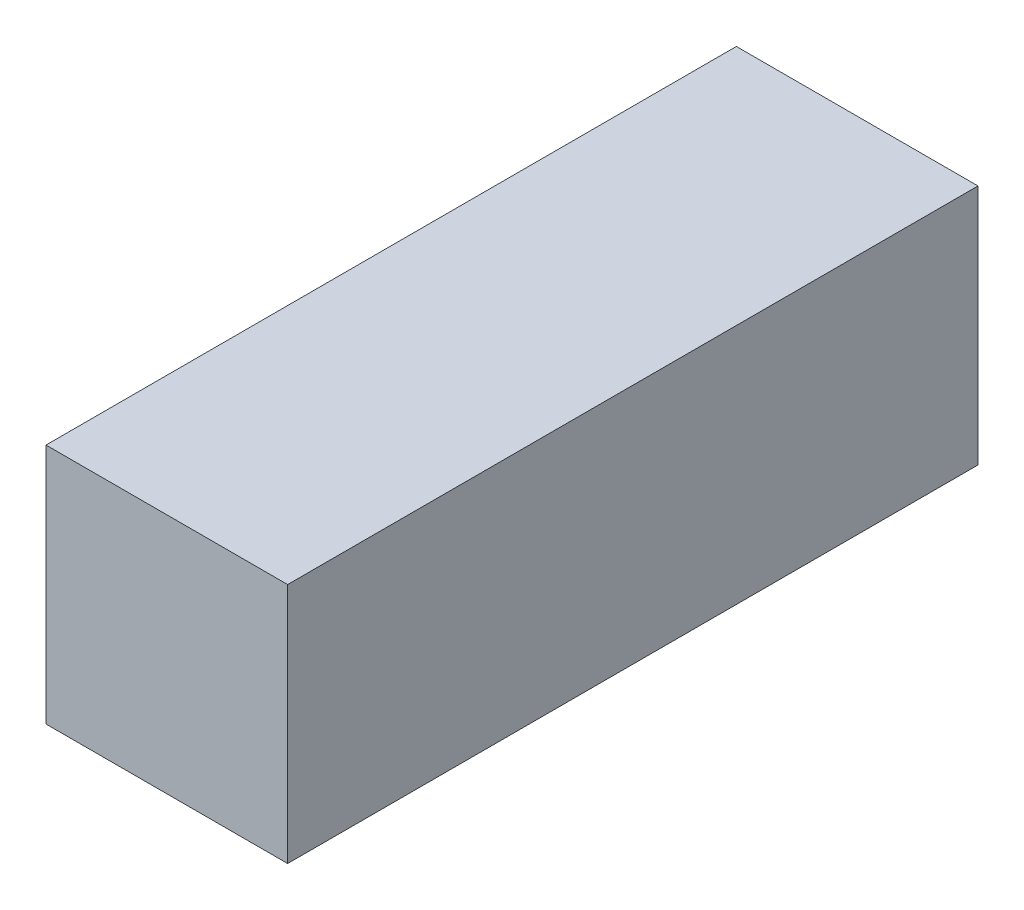
ISO-10303-21;
HEADER;
FILE_DESCRIPTION(('STEP AP214'),'2;1');
FILE_NAME('part.step','',(''),(''),'','','');
FILE_SCHEMA(('AUTOMOTIVE_DESIGN { 1 0 10303 214 1 1 1 1 }'));
ENDSEC;
DATA;
#1=APPLICATION_CONTEXT('core data for automotive mechanical design processes');
#2=APPLICATION_PROTOCOL_DEFINITION('international standard','automotive_design',2000,#1);
#3=PRODUCT_CONTEXT('',#1,'mechanical');
#4=PRODUCT('Part','Part','',(#3));
#5=PRODUCT_RELATED_PRODUCT_CATEGORY('part','',(#4));
#6=PRODUCT_DEFINITION_FORMATION('','',#4);
#7=PRODUCT_DEFINITION_CONTEXT('part definition',#1,'design');
#8=PRODUCT_DEFINITION('design','',#6,#7);
#9=PRODUCT_DEFINITION_SHAPE('','',#8);
#10=(LENGTH_UNIT() NAMED_UNIT(*) SI_UNIT(.MILLI.,.METRE.));
#11=(NAMED_UNIT(*) PLANE_ANGLE_UNIT() SI_UNIT($,.RADIAN.));
#12=(NAMED_UNIT(*) SI_UNIT($,.STERADIAN.) SOLID_ANGLE_UNIT());
#13=UNCERTAINTY_MEASURE_WITH_UNIT(LENGTH_MEASURE(1.E-05),#10,'distance_accuracy_value','');
#14=(GEOMETRIC_REPRESENTATION_CONTEXT(3) GLOBAL_UNCERTAINTY_ASSIGNED_CONTEXT((#13)) GLOBAL_UNIT_ASSIGNED_CONTEXT((#10,
#11,#12)) REPRESENTATION_CONTEXT('',''));
#15=CARTESIAN_POINT('',(0.,0.,0.));
#16=DIRECTION('',(0.,0.,1.));
#17=DIRECTION('',(1.,0.,0.));
#18=AXIS2_PLACEMENT_3D('',#15,#16,#17);
#19=CARTESIAN_POINT('',(0.,0.,20.));
#20=DIRECTION('',(1.,0.,0.));
#21=DIRECTION('',(0.,0.,-1.));
#22=AXIS2_PLACEMENT_3D('',#19,#20,#21);
#23=PLANE('',#22);
#24=DIRECTION('',(0.,-1.,0.));
#25=VECTOR('',#24,1.);
#26=CARTESIAN_POINT('',(0.,0.,0.));
#27=LINE('',#26,#25);
#28=CARTESIAN_POINT('',(0.,7.,0.));
#29=VERTEX_POINT('',#28);
#30=CARTESIAN_POINT('',(0.,0.,0.));
#31=VERTEX_POINT('',#30);
#32=EDGE_CURVE('E96',#29,#31,#27,.T.);
#33=ORIENTED_EDGE('',*,*,#32,.T.);
#34=DIRECTION('',(0.,0.,-1.));
#35=VECTOR('',#34,1.);
#36=CARTESIAN_POINT('',(0.,0.,20.));
#37=LINE('',#36,#35);
#38=CARTESIAN_POINT('',(0.,0.,20.));
#39=VERTEX_POINT('',#38);
#40=EDGE_CURVE('E11',#39,#31,#37,.T.);
#41=ORIENTED_EDGE('',*,*,#40,.F.);
#42=DIRECTION('',(0.,-1.,0.));
#43=VECTOR('',#42,1.);
#44=CARTESIAN_POINT('',(0.,0.,20.));
#45=LINE('',#44,#43);
#46=CARTESIAN_POINT('',(0.,7.,20.));
#47=VERTEX_POINT('',#46);
#48=EDGE_CURVE('E84',#47,#39,#45,.T.);
#49=ORIENTED_EDGE('',*,*,#48,.F.);
#50=DIRECTION('',(0.,0.,-1.));
#51=VECTOR('',#50,1.);
#52=CARTESIAN_POINT('',(0.,7.,20.));
#53=LINE('',#52,#51);
#54=EDGE_CURVE('E92',#47,#29,#53,.T.);
#55=ORIENTED_EDGE('',*,*,#54,.T.);
#56=EDGE_LOOP('',(#33,#41,#49,#55));
#57=FACE_BOUND('',#56,.T.);
#58=ADVANCED_FACE('F33',(#57),#23,.F.);
#59=CARTESIAN_POINT('',(0.,0.,20.));
#60=DIRECTION('',(0.,1.,0.));
#61=DIRECTION('',(0.,0.,1.));
#62=AXIS2_PLACEMENT_3D('',#59,#60,#61);
#63=PLANE('',#62);
#64=DIRECTION('',(1.,0.,0.));
#65=VECTOR('',#64,1.);
#66=CARTESIAN_POINT('',(0.,0.,0.));
#67=LINE('',#66,#65);
#68=CARTESIAN_POINT('',(7.,0.,0.));
#69=VERTEX_POINT('',#68);
#70=EDGE_CURVE('E88',#31,#69,#67,.T.);
#71=ORIENTED_EDGE('',*,*,#70,.T.);
#72=DIRECTION('',(0.,0.,-1.));
#73=VECTOR('',#72,1.);
#74=CARTESIAN_POINT('',(7.,0.,20.));
#75=LINE('',#74,#73);
#76=CARTESIAN_POINT('',(7.,0.,20.));
#77=VERTEX_POINT('',#76);
#78=EDGE_CURVE('E41',#77,#69,#75,.T.);
#79=ORIENTED_EDGE('',*,*,#78,.F.);
#80=DIRECTION('',(1.,0.,0.));
#81=VECTOR('',#80,1.);
#82=CARTESIAN_POINT('',(0.,0.,20.));
#83=LINE('',#82,#81);
#84=EDGE_CURVE('E79',#39,#77,#83,.T.);
#85=ORIENTED_EDGE('',*,*,#84,.F.);
#86=ORIENTED_EDGE('',*,*,#40,.T.);
#87=EDGE_LOOP('',(#71,#79,#85,#86));
#88=FACE_BOUND('',#87,.T.);
#89=ADVANCED_FACE('F87',(#88),#63,.F.);
#90=CARTESIAN_POINT('',(7.,0.,20.));
#91=DIRECTION('',(-1.,0.,0.));
#92=DIRECTION('',(0.,0.,1.));
#93=AXIS2_PLACEMENT_3D('',#90,#91,#92);
#94=PLANE('',#93);
#95=DIRECTION('',(0.,1.,0.));
#96=VECTOR('',#95,1.);
#97=CARTESIAN_POINT('',(7.,0.,0.));
#98=LINE('',#97,#96);
#99=CARTESIAN_POINT('',(7.,7.,0.));
#100=VERTEX_POINT('',#99);
#101=EDGE_CURVE('E66',#69,#100,#98,.T.);
#102=ORIENTED_EDGE('',*,*,#101,.T.);
#103=DIRECTION('',(0.,0.,-1.));
#104=VECTOR('',#103,1.);
#105=CARTESIAN_POINT('',(7.,7.,20.));
#106=LINE('',#105,#104);
#107=CARTESIAN_POINT('',(7.,7.,20.));
#108=VERTEX_POINT('',#107);
#109=EDGE_CURVE('E89',#108,#100,#106,.T.);
#110=ORIENTED_EDGE('',*,*,#109,.F.);
#111=DIRECTION('',(0.,1.,0.));
#112=VECTOR('',#111,1.);
#113=CARTESIAN_POINT('',(7.,0.,20.));
#114=LINE('',#113,#112);
#115=EDGE_CURVE('E82',#77,#108,#114,.T.);
#116=ORIENTED_EDGE('',*,*,#115,.F.);
#117=ORIENTED_EDGE('',*,*,#78,.T.);
#118=EDGE_LOOP('',(#102,#110,#116,#117));
#119=FACE_BOUND('',#118,.T.);
#120=ADVANCED_FACE('F90',(#119),#94,.F.);
#121=CARTESIAN_POINT('',(0.,7.,20.));
#122=DIRECTION('',(0.,-1.,0.));
#123=DIRECTION('',(0.,0.,-1.));
#124=AXIS2_PLACEMENT_3D('',#121,#122,#123);
#125=PLANE('',#124);
#126=DIRECTION('',(-1.,0.,0.));
#127=VECTOR('',#126,1.);
#128=CARTESIAN_POINT('',(0.,7.,0.));
#129=LINE('',#128,#127);
#130=EDGE_CURVE('E72',#100,#29,#129,.T.);
#131=ORIENTED_EDGE('',*,*,#130,.T.);
#132=ORIENTED_EDGE('',*,*,#54,.F.);
#133=DIRECTION('',(-1.,0.,0.));
#134=VECTOR('',#133,1.);
#135=CARTESIAN_POINT('',(0.,7.,20.));
#136=LINE('',#135,#134);
#137=EDGE_CURVE('E49',#108,#47,#136,.T.);
#138=ORIENTED_EDGE('',*,*,#137,.F.);
#139=ORIENTED_EDGE('',*,*,#109,.T.);
#140=EDGE_LOOP('',(#131,#132,#138,#139));
#141=FACE_BOUND('',#140,.T.);
#142=ADVANCED_FACE('F103',(#141),#125,.F.);
#143=CARTESIAN_POINT('',(0.,0.,20.));
#144=DIRECTION('',(0.,0.,-1.));
#145=DIRECTION('',(-1.,0.,0.));
#146=AXIS2_PLACEMENT_3D('',#143,#144,#145);
#147=PLANE('',#146);
#148=ORIENTED_EDGE('',*,*,#48,.T.);
#149=ORIENTED_EDGE('',*,*,#84,.T.);
#150=ORIENTED_EDGE('',*,*,#115,.T.);
#151=ORIENTED_EDGE('',*,*,#137,.T.);
#152=EDGE_LOOP('',(#148,#149,#150,#151));
#153=FACE_BOUND('',#152,.T.);
#154=ADVANCED_FACE('F80',(#153),#147,.F.);
#155=CARTESIAN_POINT('',(0.,0.,0.));
#156=DIRECTION('',(0.,0.,-1.));
#157=DIRECTION('',(-1.,0.,0.));
#158=AXIS2_PLACEMENT_3D('',#155,#156,#157);
#159=PLANE('',#158);
#160=ORIENTED_EDGE('',*,*,#32,.F.);
#161=ORIENTED_EDGE('',*,*,#130,.F.);
#162=ORIENTED_EDGE('',*,*,#101,.F.);
#163=ORIENTED_EDGE('',*,*,#70,.F.);
#164=EDGE_LOOP('',(#160,#161,#162,#163));
#165=FACE_BOUND('',#164,.T.);
#166=ADVANCED_FACE('F106',(#165),#159,.T.);
#167=CLOSED_SHELL('',(#58,#89,#120,#142,#154,#166));
#168=MANIFOLD_SOLID_BREP('B2',#167);
#169=ADVANCED_BREP_SHAPE_REPRESENTATION('',(#18,#168),#14);
#170=SHAPE_DEFINITION_REPRESENTATION(#9,#169);
ENDSEC;
END-ISO-10303-21;
